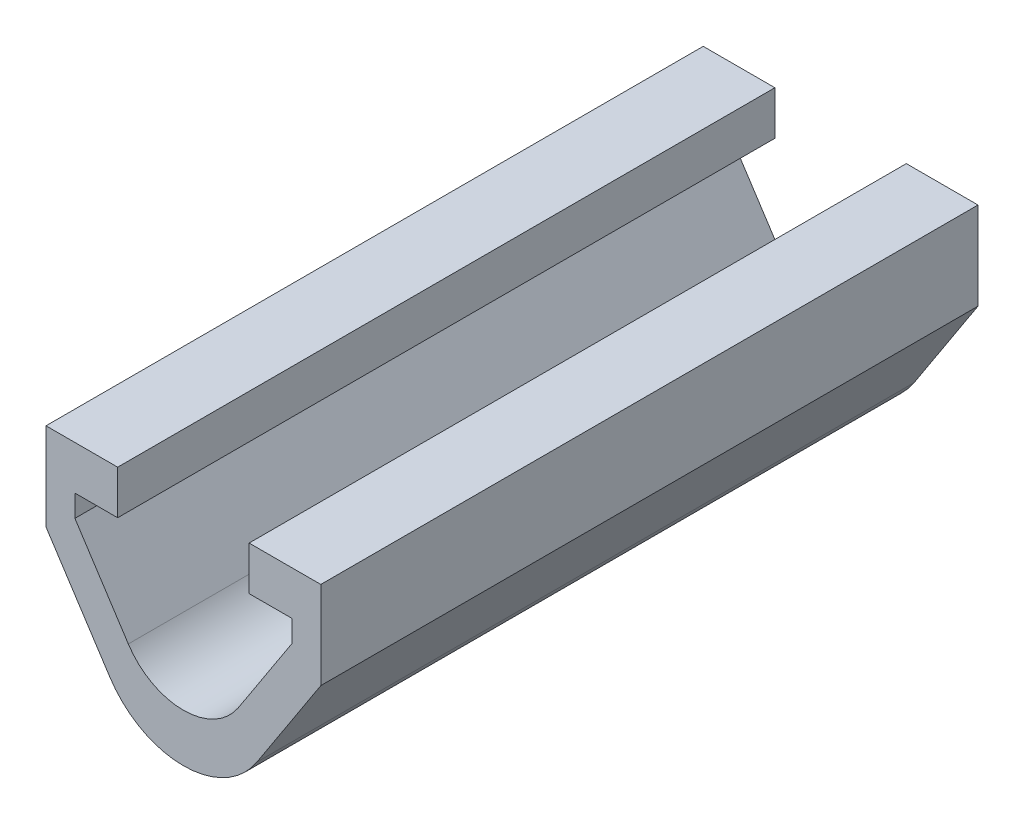
ISO-10303-21;
HEADER;
FILE_DESCRIPTION(('STEP AP214'),'2;1');
FILE_NAME('part.step','',(''),(''),'','','');
FILE_SCHEMA(('AUTOMOTIVE_DESIGN { 1 0 10303 214 1 1 1 1 }'));
ENDSEC;
DATA;
#1=APPLICATION_CONTEXT('core data for automotive mechanical design processes');
#2=APPLICATION_PROTOCOL_DEFINITION('international standard','automotive_design',2000,#1);
#3=PRODUCT_CONTEXT('',#1,'mechanical');
#4=PRODUCT('Part','Part','',(#3));
#5=PRODUCT_RELATED_PRODUCT_CATEGORY('part','',(#4));
#6=PRODUCT_DEFINITION_FORMATION('','',#4);
#7=PRODUCT_DEFINITION_CONTEXT('part definition',#1,'design');
#8=PRODUCT_DEFINITION('design','',#6,#7);
#9=PRODUCT_DEFINITION_SHAPE('','',#8);
#10=(LENGTH_UNIT() NAMED_UNIT(*) SI_UNIT(.MILLI.,.METRE.));
#11=(NAMED_UNIT(*) PLANE_ANGLE_UNIT() SI_UNIT($,.RADIAN.));
#12=(NAMED_UNIT(*) SI_UNIT($,.STERADIAN.) SOLID_ANGLE_UNIT());
#13=UNCERTAINTY_MEASURE_WITH_UNIT(LENGTH_MEASURE(1.E-05),#10,'distance_accuracy_value','');
#14=(GEOMETRIC_REPRESENTATION_CONTEXT(3) GLOBAL_UNCERTAINTY_ASSIGNED_CONTEXT((#13)) GLOBAL_UNIT_ASSIGNED_CONTEXT((#10,
#11,#12)) REPRESENTATION_CONTEXT('',''));
#15=CARTESIAN_POINT('',(0.,0.,0.));
#16=DIRECTION('',(0.,0.,1.));
#17=DIRECTION('',(1.,0.,0.));
#18=AXIS2_PLACEMENT_3D('',#15,#16,#17);
#19=CARTESIAN_POINT('',(-6.27176837943347,-2.50000000000001,30.));
#20=DIRECTION('',(1.,0.,0.));
#21=DIRECTION('',(0.,1.,0.));
#22=AXIS2_PLACEMENT_3D('',#19,#20,#21);
#23=PLANE('',#22);
#24=DIRECTION('',(0.,-1.,0.));
#25=VECTOR('',#24,1.);
#26=CARTESIAN_POINT('',(-6.27176837943347,-2.50000000000001,0.));
#27=LINE('',#26,#25);
#28=CARTESIAN_POINT('',(-6.27176837943347,-2.50000000000001,0.));
#29=VERTEX_POINT('',#28);
#30=CARTESIAN_POINT('',(-6.27176837943347,-6.50000000000001,0.));
#31=VERTEX_POINT('',#30);
#32=EDGE_CURVE('E177',#29,#31,#27,.T.);
#33=ORIENTED_EDGE('',*,*,#32,.T.);
#34=DIRECTION('',(0.,0.,-1.));
#35=VECTOR('',#34,1.);
#36=CARTESIAN_POINT('',(-6.27176837943347,-6.50000000000001,30.));
#37=LINE('',#36,#35);
#38=CARTESIAN_POINT('',(-6.27176837943347,-6.50000000000001,30.));
#39=VERTEX_POINT('',#38);
#40=EDGE_CURVE('E11',#39,#31,#37,.T.);
#41=ORIENTED_EDGE('',*,*,#40,.F.);
#42=DIRECTION('',(0.,-1.,0.));
#43=VECTOR('',#42,1.);
#44=CARTESIAN_POINT('',(-6.27176837943347,-2.50000000000001,30.));
#45=LINE('',#44,#43);
#46=CARTESIAN_POINT('',(-6.27176837943347,-2.50000000000001,30.));
#47=VERTEX_POINT('',#46);
#48=EDGE_CURVE('E214',#47,#39,#45,.T.);
#49=ORIENTED_EDGE('',*,*,#48,.F.);
#50=DIRECTION('',(0.,0.,-1.));
#51=VECTOR('',#50,1.);
#52=CARTESIAN_POINT('',(-6.27176837943347,-2.50000000000001,30.));
#53=LINE('',#52,#51);
#54=EDGE_CURVE('E173',#47,#29,#53,.T.);
#55=ORIENTED_EDGE('',*,*,#54,.T.);
#56=EDGE_LOOP('',(#33,#41,#49,#55));
#57=FACE_BOUND('',#56,.T.);
#58=ADVANCED_FACE('F33',(#57),#23,.F.);
#59=CARTESIAN_POINT('',(-6.27176837943347,-6.50000000000001,30.));
#60=DIRECTION('',(0.838139532599552,0.545455886294946,0.));
#61=DIRECTION('',(-0.545455886294946,0.838139532599552,0.));
#62=AXIS2_PLACEMENT_3D('',#59,#60,#61);
#63=PLANE('',#62);
#64=DIRECTION('',(0.545455886294946,-0.838139532599552,0.));
#65=VECTOR('',#64,1.);
#66=CARTESIAN_POINT('',(-6.27176837943347,-6.50000000000001,0.));
#67=LINE('',#66,#65);
#68=CARTESIAN_POINT('',(-3.35255813039823,-10.9856157485176,0.));
#69=VERTEX_POINT('',#68);
#70=EDGE_CURVE('E180',#31,#69,#67,.T.);
#71=ORIENTED_EDGE('',*,*,#70,.T.);
#72=DIRECTION('',(0.,0.,-1.));
#73=VECTOR('',#72,1.);
#74=CARTESIAN_POINT('',(-3.35255813039823,-10.9856157485176,30.));
#75=LINE('',#74,#73);
#76=CARTESIAN_POINT('',(-3.35255813039823,-10.9856157485176,30.));
#77=VERTEX_POINT('',#76);
#78=EDGE_CURVE('E41',#77,#69,#75,.T.);
#79=ORIENTED_EDGE('',*,*,#78,.F.);
#80=DIRECTION('',(0.545455886294946,-0.838139532599552,0.));
#81=VECTOR('',#80,1.);
#82=CARTESIAN_POINT('',(-6.27176837943347,-6.50000000000001,30.));
#83=LINE('',#82,#81);
#84=EDGE_CURVE('E116',#39,#77,#83,.T.);
#85=ORIENTED_EDGE('',*,*,#84,.F.);
#86=ORIENTED_EDGE('',*,*,#40,.T.);
#87=EDGE_LOOP('',(#71,#79,#85,#86));
#88=FACE_BOUND('',#87,.T.);
#89=ADVANCED_FACE('F313',(#88),#63,.F.);
#90=CARTESIAN_POINT('',(0.,-8.80379220333782,30.));
#91=DIRECTION('',(0.,0.,-1.));
#92=DIRECTION('',(-1.,0.,0.));
#93=AXIS2_PLACEMENT_3D('',#90,#91,#92);
#94=CYLINDRICAL_SURFACE('',#93,4.);
#95=CARTESIAN_POINT('',(0.,-8.80379220333782,0.));
#96=DIRECTION('',(0.,0.,1.));
#97=DIRECTION('',(1.,0.,0.));
#98=AXIS2_PLACEMENT_3D('',#95,#96,#97);
#99=CIRCLE('',#98,4.);
#100=CARTESIAN_POINT('',(3.35255813039823,-10.9856157485176,0.));
#101=VERTEX_POINT('',#100);
#102=EDGE_CURVE('E182',#69,#101,#99,.T.);
#103=ORIENTED_EDGE('',*,*,#102,.T.);
#104=DIRECTION('',(0.,0.,-1.));
#105=VECTOR('',#104,1.);
#106=CARTESIAN_POINT('',(3.35255813039823,-10.9856157485176,30.));
#107=LINE('',#106,#105);
#108=CARTESIAN_POINT('',(3.35255813039823,-10.9856157485176,30.));
#109=VERTEX_POINT('',#108);
#110=EDGE_CURVE('E239',#109,#101,#107,.T.);
#111=ORIENTED_EDGE('',*,*,#110,.F.);
#112=CARTESIAN_POINT('',(0.,-8.80379220333782,30.));
#113=DIRECTION('',(0.,0.,1.));
#114=DIRECTION('',(1.,0.,0.));
#115=AXIS2_PLACEMENT_3D('',#112,#113,#114);
#116=CIRCLE('',#115,4.);
#117=EDGE_CURVE('E247',#77,#109,#116,.T.);
#118=ORIENTED_EDGE('',*,*,#117,.F.);
#119=ORIENTED_EDGE('',*,*,#78,.T.);
#120=EDGE_LOOP('',(#103,#111,#118,#119));
#121=FACE_BOUND('',#120,.T.);
#122=ADVANCED_FACE('F245',(#121),#94,.T.);
#123=CARTESIAN_POINT('',(3.35255813039823,-10.9856157485176,30.));
#124=DIRECTION('',(-0.838139532599551,0.545455886294946,0.));
#125=DIRECTION('',(-0.545455886294946,-0.838139532599552,0.));
#126=AXIS2_PLACEMENT_3D('',#123,#124,#125);
#127=PLANE('',#126);
#128=DIRECTION('',(0.545455886294946,0.838139532599552,0.));
#129=VECTOR('',#128,1.);
#130=CARTESIAN_POINT('',(3.35255813039823,-10.9856157485176,0.));
#131=LINE('',#130,#129);
#132=CARTESIAN_POINT('',(6.27176837943347,-6.50000000000001,0.));
#133=VERTEX_POINT('',#132);
#134=EDGE_CURVE('E184',#101,#133,#131,.T.);
#135=ORIENTED_EDGE('',*,*,#134,.T.);
#136=DIRECTION('',(0.,0.,-1.));
#137=VECTOR('',#136,1.);
#138=CARTESIAN_POINT('',(6.27176837943347,-6.50000000000001,30.));
#139=LINE('',#138,#137);
#140=CARTESIAN_POINT('',(6.27176837943347,-6.50000000000001,30.));
#141=VERTEX_POINT('',#140);
#142=EDGE_CURVE('E237',#141,#133,#139,.T.);
#143=ORIENTED_EDGE('',*,*,#142,.F.);
#144=DIRECTION('',(0.545455886294946,0.838139532599552,0.));
#145=VECTOR('',#144,1.);
#146=CARTESIAN_POINT('',(3.35255813039823,-10.9856157485176,30.));
#147=LINE('',#146,#145);
#148=EDGE_CURVE('E258',#109,#141,#147,.T.);
#149=ORIENTED_EDGE('',*,*,#148,.F.);
#150=ORIENTED_EDGE('',*,*,#110,.T.);
#151=EDGE_LOOP('',(#135,#143,#149,#150));
#152=FACE_BOUND('',#151,.T.);
#153=ADVANCED_FACE('F255',(#152),#127,.F.);
#154=CARTESIAN_POINT('',(6.27176837943347,-2.50000000000001,30.));
#155=DIRECTION('',(1.,0.,0.));
#156=DIRECTION('',(0.,1.,0.));
#157=AXIS2_PLACEMENT_3D('',#154,#155,#156);
#158=PLANE('',#157);
#159=DIRECTION('',(0.,-1.,0.));
#160=VECTOR('',#159,1.);
#161=CARTESIAN_POINT('',(6.27176837943347,-2.50000000000001,0.));
#162=LINE('',#161,#160);
#163=CARTESIAN_POINT('',(6.27176837943347,-2.50000000000001,0.));
#164=VERTEX_POINT('',#163);
#165=EDGE_CURVE('E187',#164,#133,#162,.T.);
#166=ORIENTED_EDGE('',*,*,#165,.F.);
#167=DIRECTION('',(0.,0.,-1.));
#168=VECTOR('',#167,1.);
#169=CARTESIAN_POINT('',(6.27176837943347,-2.50000000000001,30.));
#170=LINE('',#169,#168);
#171=CARTESIAN_POINT('',(6.27176837943347,-2.50000000000001,30.));
#172=VERTEX_POINT('',#171);
#173=EDGE_CURVE('E235',#172,#164,#170,.T.);
#174=ORIENTED_EDGE('',*,*,#173,.F.);
#175=DIRECTION('',(0.,-1.,0.));
#176=VECTOR('',#175,1.);
#177=CARTESIAN_POINT('',(6.27176837943347,-2.50000000000001,30.));
#178=LINE('',#177,#176);
#179=EDGE_CURVE('E260',#172,#141,#178,.T.);
#180=ORIENTED_EDGE('',*,*,#179,.T.);
#181=ORIENTED_EDGE('',*,*,#142,.T.);
#182=EDGE_LOOP('',(#166,#174,#180,#181));
#183=FACE_BOUND('',#182,.T.);
#184=ADVANCED_FACE('F324',(#183),#158,.T.);
#185=CARTESIAN_POINT('',(3.,-2.50000000000001,30.));
#186=DIRECTION('',(0.,1.,0.));
#187=DIRECTION('',(-1.,0.,0.));
#188=AXIS2_PLACEMENT_3D('',#185,#186,#187);
#189=PLANE('',#188);
#190=DIRECTION('',(1.,0.,0.));
#191=VECTOR('',#190,1.);
#192=CARTESIAN_POINT('',(3.,-2.50000000000001,0.));
#193=LINE('',#192,#191);
#194=CARTESIAN_POINT('',(3.,-2.50000000000001,0.));
#195=VERTEX_POINT('',#194);
#196=EDGE_CURVE('E190',#195,#164,#193,.T.);
#197=ORIENTED_EDGE('',*,*,#196,.F.);
#198=DIRECTION('',(0.,0.,-1.));
#199=VECTOR('',#198,1.);
#200=CARTESIAN_POINT('',(3.,-2.50000000000001,30.));
#201=LINE('',#200,#199);
#202=CARTESIAN_POINT('',(3.,-2.50000000000001,30.));
#203=VERTEX_POINT('',#202);
#204=EDGE_CURVE('E233',#203,#195,#201,.T.);
#205=ORIENTED_EDGE('',*,*,#204,.F.);
#206=DIRECTION('',(1.,0.,0.));
#207=VECTOR('',#206,1.);
#208=CARTESIAN_POINT('',(3.,-2.50000000000001,30.));
#209=LINE('',#208,#207);
#210=EDGE_CURVE('E262',#203,#172,#209,.T.);
#211=ORIENTED_EDGE('',*,*,#210,.T.);
#212=ORIENTED_EDGE('',*,*,#173,.T.);
#213=EDGE_LOOP('',(#197,#205,#211,#212));
#214=FACE_BOUND('',#213,.T.);
#215=ADVANCED_FACE('F327',(#214),#189,.T.);
#216=CARTESIAN_POINT('',(3.,-4.50000000000001,30.));
#217=DIRECTION('',(-1.,0.,0.));
#218=DIRECTION('',(0.,-1.,0.));
#219=AXIS2_PLACEMENT_3D('',#216,#217,#218);
#220=PLANE('',#219);
#221=DIRECTION('',(0.,1.,0.));
#222=VECTOR('',#221,1.);
#223=CARTESIAN_POINT('',(3.,-4.50000000000001,0.));
#224=LINE('',#223,#222);
#225=CARTESIAN_POINT('',(3.,-4.50000000000001,0.));
#226=VERTEX_POINT('',#225);
#227=EDGE_CURVE('E193',#226,#195,#224,.T.);
#228=ORIENTED_EDGE('',*,*,#227,.F.);
#229=DIRECTION('',(0.,0.,-1.));
#230=VECTOR('',#229,1.);
#231=CARTESIAN_POINT('',(3.,-4.50000000000001,30.));
#232=LINE('',#231,#230);
#233=CARTESIAN_POINT('',(3.,-4.50000000000001,30.));
#234=VERTEX_POINT('',#233);
#235=EDGE_CURVE('E231',#234,#226,#232,.T.);
#236=ORIENTED_EDGE('',*,*,#235,.F.);
#237=DIRECTION('',(0.,1.,0.));
#238=VECTOR('',#237,1.);
#239=CARTESIAN_POINT('',(3.,-4.50000000000001,30.));
#240=LINE('',#239,#238);
#241=EDGE_CURVE('E269',#234,#203,#240,.T.);
#242=ORIENTED_EDGE('',*,*,#241,.T.);
#243=ORIENTED_EDGE('',*,*,#204,.T.);
#244=EDGE_LOOP('',(#228,#236,#242,#243));
#245=FACE_BOUND('',#244,.T.);
#246=ADVANCED_FACE('F331',(#245),#220,.T.);
#247=CARTESIAN_POINT('',(4.95238095238095,-4.50000000000001,30.));
#248=DIRECTION('',(0.,-1.,0.));
#249=DIRECTION('',(0.,0.,-1.));
#250=AXIS2_PLACEMENT_3D('',#247,#248,#249);
#251=PLANE('',#250);
#252=DIRECTION('',(-1.,0.,0.));
#253=VECTOR('',#252,1.);
#254=CARTESIAN_POINT('',(4.95238095238095,-4.50000000000001,0.));
#255=LINE('',#254,#253);
#256=CARTESIAN_POINT('',(4.95238095238095,-4.50000000000001,0.));
#257=VERTEX_POINT('',#256);
#258=EDGE_CURVE('E196',#257,#226,#255,.T.);
#259=ORIENTED_EDGE('',*,*,#258,.F.);
#260=DIRECTION('',(0.,0.,-1.));
#261=VECTOR('',#260,1.);
#262=CARTESIAN_POINT('',(4.95238095238095,-4.50000000000001,30.));
#263=LINE('',#262,#261);
#264=CARTESIAN_POINT('',(4.95238095238095,-4.50000000000001,30.));
#265=VERTEX_POINT('',#264);
#266=EDGE_CURVE('E229',#265,#257,#263,.T.);
#267=ORIENTED_EDGE('',*,*,#266,.F.);
#268=DIRECTION('',(-1.,0.,0.));
#269=VECTOR('',#268,1.);
#270=CARTESIAN_POINT('',(4.95238095238095,-4.50000000000001,30.));
#271=LINE('',#270,#269);
#272=EDGE_CURVE('E272',#265,#234,#271,.T.);
#273=ORIENTED_EDGE('',*,*,#272,.T.);
#274=ORIENTED_EDGE('',*,*,#235,.T.);
#275=EDGE_LOOP('',(#259,#267,#273,#274));
#276=FACE_BOUND('',#275,.T.);
#277=ADVANCED_FACE('F335',(#276),#251,.T.);
#278=CARTESIAN_POINT('',(4.95238095238095,-5.50000000000001,30.));
#279=DIRECTION('',(-1.,0.,0.));
#280=DIRECTION('',(0.,0.,1.));
#281=AXIS2_PLACEMENT_3D('',#278,#279,#280);
#282=PLANE('',#281);
#283=DIRECTION('',(0.,1.,0.));
#284=VECTOR('',#283,1.);
#285=CARTESIAN_POINT('',(4.95238095238095,-5.50000000000001,0.));
#286=LINE('',#285,#284);
#287=CARTESIAN_POINT('',(4.95238095238095,-5.50000000000001,0.));
#288=VERTEX_POINT('',#287);
#289=EDGE_CURVE('E199',#288,#257,#286,.T.);
#290=ORIENTED_EDGE('',*,*,#289,.F.);
#291=DIRECTION('',(0.,0.,-1.));
#292=VECTOR('',#291,1.);
#293=CARTESIAN_POINT('',(4.95238095238095,-5.50000000000001,30.));
#294=LINE('',#293,#292);
#295=CARTESIAN_POINT('',(4.95238095238095,-5.50000000000001,30.));
#296=VERTEX_POINT('',#295);
#297=EDGE_CURVE('E226',#296,#288,#294,.T.);
#298=ORIENTED_EDGE('',*,*,#297,.F.);
#299=DIRECTION('',(0.,1.,0.));
#300=VECTOR('',#299,1.);
#301=CARTESIAN_POINT('',(4.95238095238095,-5.50000000000001,30.));
#302=LINE('',#301,#300);
#303=EDGE_CURVE('E275',#296,#265,#302,.T.);
#304=ORIENTED_EDGE('',*,*,#303,.T.);
#305=ORIENTED_EDGE('',*,*,#266,.T.);
#306=EDGE_LOOP('',(#290,#298,#304,#305));
#307=FACE_BOUND('',#306,.T.);
#308=ADVANCED_FACE('F339',(#307),#282,.T.);
#309=CARTESIAN_POINT('',(2.51441859779867,-9.24613727655327,30.));
#310=DIRECTION('',(-0.838139532599552,0.545455886294946,0.));
#311=DIRECTION('',(-0.545455886294946,-0.838139532599552,0.));
#312=AXIS2_PLACEMENT_3D('',#309,#310,#311);
#313=PLANE('',#312);
#314=DIRECTION('',(0.545455886294946,0.838139532599552,0.));
#315=VECTOR('',#314,1.);
#316=CARTESIAN_POINT('',(2.51441859779867,-9.24613727655327,0.));
#317=LINE('',#316,#315);
#318=CARTESIAN_POINT('',(2.51441859779867,-9.24613727655327,0.));
#319=VERTEX_POINT('',#318);
#320=EDGE_CURVE('E202',#319,#288,#317,.T.);
#321=ORIENTED_EDGE('',*,*,#320,.F.);
#322=DIRECTION('',(0.,0.,-1.));
#323=VECTOR('',#322,1.);
#324=CARTESIAN_POINT('',(2.51441859779867,-9.24613727655327,30.));
#325=LINE('',#324,#323);
#326=CARTESIAN_POINT('',(2.51441859779867,-9.24613727655327,30.));
#327=VERTEX_POINT('',#326);
#328=EDGE_CURVE('E224',#327,#319,#325,.T.);
#329=ORIENTED_EDGE('',*,*,#328,.F.);
#330=DIRECTION('',(0.545455886294946,0.838139532599551,0.));
#331=VECTOR('',#330,1.);
#332=CARTESIAN_POINT('',(3.,-8.50000000000001,30.));
#333=LINE('',#332,#331);
#334=EDGE_CURVE('E278',#327,#296,#333,.T.);
#335=ORIENTED_EDGE('',*,*,#334,.T.);
#336=ORIENTED_EDGE('',*,*,#297,.T.);
#337=EDGE_LOOP('',(#321,#329,#335,#336));
#338=FACE_BOUND('',#337,.T.);
#339=ADVANCED_FACE('F343',(#338),#313,.T.);
#340=CARTESIAN_POINT('',(0.,-7.60976961766846,30.));
#341=DIRECTION('',(0.,0.,-1.));
#342=DIRECTION('',(-1.,0.,0.));
#343=AXIS2_PLACEMENT_3D('',#340,#341,#342);
#344=CYLINDRICAL_SURFACE('',#343,3.);
#345=CARTESIAN_POINT('',(0.,-7.60976961766846,0.));
#346=DIRECTION('',(0.,0.,1.));
#347=DIRECTION('',(1.,0.,0.));
#348=AXIS2_PLACEMENT_3D('',#345,#346,#347);
#349=CIRCLE('',#348,3.);
#350=CARTESIAN_POINT('',(-2.51441859779867,-9.24613727655327,0.));
#351=VERTEX_POINT('',#350);
#352=EDGE_CURVE('E204',#351,#319,#349,.T.);
#353=ORIENTED_EDGE('',*,*,#352,.F.);
#354=DIRECTION('',(0.,0.,-1.));
#355=VECTOR('',#354,1.);
#356=CARTESIAN_POINT('',(-2.51441859779867,-9.24613727655327,30.));
#357=LINE('',#356,#355);
#358=CARTESIAN_POINT('',(-2.51441859779867,-9.24613727655327,30.));
#359=VERTEX_POINT('',#358);
#360=EDGE_CURVE('E221',#359,#351,#357,.T.);
#361=ORIENTED_EDGE('',*,*,#360,.F.);
#362=CARTESIAN_POINT('',(0.,-7.60976961766846,30.));
#363=DIRECTION('',(0.,0.,1.));
#364=DIRECTION('',(1.,0.,0.));
#365=AXIS2_PLACEMENT_3D('',#362,#363,#364);
#366=CIRCLE('',#365,3.);
#367=EDGE_CURVE('E281',#359,#327,#366,.T.);
#368=ORIENTED_EDGE('',*,*,#367,.T.);
#369=ORIENTED_EDGE('',*,*,#328,.T.);
#370=EDGE_LOOP('',(#353,#361,#368,#369));
#371=FACE_BOUND('',#370,.T.);
#372=ADVANCED_FACE('F294',(#371),#344,.F.);
#373=CARTESIAN_POINT('',(-3.,-8.50000000000001,30.));
#374=DIRECTION('',(-0.838139532599552,-0.545455886294946,0.));
#375=DIRECTION('',(0.545455886294946,-0.838139532599552,0.));
#376=AXIS2_PLACEMENT_3D('',#373,#374,#375);
#377=PLANE('',#376);
#378=DIRECTION('',(-0.545455886294946,0.838139532599552,0.));
#379=VECTOR('',#378,1.);
#380=CARTESIAN_POINT('',(-3.,-8.50000000000001,0.));
#381=LINE('',#380,#379);
#382=CARTESIAN_POINT('',(-4.95238095238095,-5.50000000000001,0.));
#383=VERTEX_POINT('',#382);
#384=EDGE_CURVE('E207',#351,#383,#381,.T.);
#385=ORIENTED_EDGE('',*,*,#384,.T.);
#386=DIRECTION('',(0.,0.,-1.));
#387=VECTOR('',#386,1.);
#388=CARTESIAN_POINT('',(-4.95238095238095,-5.50000000000001,30.));
#389=LINE('',#388,#387);
#390=CARTESIAN_POINT('',(-4.95238095238095,-5.50000000000001,30.));
#391=VERTEX_POINT('',#390);
#392=EDGE_CURVE('E218',#391,#383,#389,.T.);
#393=ORIENTED_EDGE('',*,*,#392,.F.);
#394=DIRECTION('',(0.545455886294946,-0.838139532599552,0.));
#395=VECTOR('',#394,1.);
#396=CARTESIAN_POINT('',(-3.,-8.50000000000001,30.));
#397=LINE('',#396,#395);
#398=EDGE_CURVE('E284',#391,#359,#397,.T.);
#399=ORIENTED_EDGE('',*,*,#398,.T.);
#400=ORIENTED_EDGE('',*,*,#360,.T.);
#401=EDGE_LOOP('',(#385,#393,#399,#400));
#402=FACE_BOUND('',#401,.T.);
#403=ADVANCED_FACE('F288',(#402),#377,.F.);
#404=CARTESIAN_POINT('',(-4.95238095238095,-5.50000000000001,30.));
#405=DIRECTION('',(-1.,0.,0.));
#406=DIRECTION('',(0.,0.,1.));
#407=AXIS2_PLACEMENT_3D('',#404,#405,#406);
#408=PLANE('',#407);
#409=DIRECTION('',(0.,1.,0.));
#410=VECTOR('',#409,1.);
#411=CARTESIAN_POINT('',(-4.95238095238095,-5.50000000000001,0.));
#412=LINE('',#411,#410);
#413=CARTESIAN_POINT('',(-4.95238095238095,-4.50000000000001,0.));
#414=VERTEX_POINT('',#413);
#415=EDGE_CURVE('E209',#383,#414,#412,.T.);
#416=ORIENTED_EDGE('',*,*,#415,.T.);
#417=DIRECTION('',(0.,0.,-1.));
#418=VECTOR('',#417,1.);
#419=CARTESIAN_POINT('',(-4.95238095238095,-4.50000000000001,30.));
#420=LINE('',#419,#418);
#421=CARTESIAN_POINT('',(-4.95238095238095,-4.50000000000001,30.));
#422=VERTEX_POINT('',#421);
#423=EDGE_CURVE('E168',#422,#414,#420,.T.);
#424=ORIENTED_EDGE('',*,*,#423,.F.);
#425=DIRECTION('',(0.,1.,0.));
#426=VECTOR('',#425,1.);
#427=CARTESIAN_POINT('',(-4.95238095238095,-5.50000000000001,30.));
#428=LINE('',#427,#426);
#429=EDGE_CURVE('E159',#391,#422,#428,.T.);
#430=ORIENTED_EDGE('',*,*,#429,.F.);
#431=ORIENTED_EDGE('',*,*,#392,.T.);
#432=EDGE_LOOP('',(#416,#424,#430,#431));
#433=FACE_BOUND('',#432,.T.);
#434=ADVANCED_FACE('F298',(#433),#408,.F.);
#435=CARTESIAN_POINT('',(-4.95238095238095,-4.50000000000001,30.));
#436=DIRECTION('',(0.,1.,0.));
#437=DIRECTION('',(0.,0.,1.));
#438=AXIS2_PLACEMENT_3D('',#435,#436,#437);
#439=PLANE('',#438);
#440=DIRECTION('',(1.,0.,0.));
#441=VECTOR('',#440,1.);
#442=CARTESIAN_POINT('',(-4.95238095238095,-4.50000000000001,0.));
#443=LINE('',#442,#441);
#444=CARTESIAN_POINT('',(-3.,-4.50000000000001,0.));
#445=VERTEX_POINT('',#444);
#446=EDGE_CURVE('E167',#414,#445,#443,.T.);
#447=ORIENTED_EDGE('',*,*,#446,.T.);
#448=DIRECTION('',(0.,0.,-1.));
#449=VECTOR('',#448,1.);
#450=CARTESIAN_POINT('',(-3.,-4.50000000000001,30.));
#451=LINE('',#450,#449);
#452=CARTESIAN_POINT('',(-3.,-4.50000000000001,30.));
#453=VERTEX_POINT('',#452);
#454=EDGE_CURVE('E164',#453,#445,#451,.T.);
#455=ORIENTED_EDGE('',*,*,#454,.F.);
#456=DIRECTION('',(1.,0.,0.));
#457=VECTOR('',#456,1.);
#458=CARTESIAN_POINT('',(-4.95238095238095,-4.50000000000001,30.));
#459=LINE('',#458,#457);
#460=EDGE_CURVE('E153',#422,#453,#459,.T.);
#461=ORIENTED_EDGE('',*,*,#460,.F.);
#462=ORIENTED_EDGE('',*,*,#423,.T.);
#463=EDGE_LOOP('',(#447,#455,#461,#462));
#464=FACE_BOUND('',#463,.T.);
#465=ADVANCED_FACE('F165',(#464),#439,.F.);
#466=CARTESIAN_POINT('',(-3.,-4.50000000000001,30.));
#467=DIRECTION('',(-1.,0.,0.));
#468=DIRECTION('',(0.,-1.,0.));
#469=AXIS2_PLACEMENT_3D('',#466,#467,#468);
#470=PLANE('',#469);
#471=DIRECTION('',(0.,1.,0.));
#472=VECTOR('',#471,1.);
#473=CARTESIAN_POINT('',(-3.,-4.50000000000001,0.));
#474=LINE('',#473,#472);
#475=CARTESIAN_POINT('',(-3.,-2.50000000000001,0.));
#476=VERTEX_POINT('',#475);
#477=EDGE_CURVE('E102',#445,#476,#474,.T.);
#478=ORIENTED_EDGE('',*,*,#477,.T.);
#479=DIRECTION('',(0.,0.,-1.));
#480=VECTOR('',#479,1.);
#481=CARTESIAN_POINT('',(-3.,-2.50000000000001,30.));
#482=LINE('',#481,#480);
#483=CARTESIAN_POINT('',(-3.,-2.50000000000001,30.));
#484=VERTEX_POINT('',#483);
#485=EDGE_CURVE('E169',#484,#476,#482,.T.);
#486=ORIENTED_EDGE('',*,*,#485,.F.);
#487=DIRECTION('',(0.,1.,0.));
#488=VECTOR('',#487,1.);
#489=CARTESIAN_POINT('',(-3.,-4.50000000000001,30.));
#490=LINE('',#489,#488);
#491=EDGE_CURVE('E157',#453,#484,#490,.T.);
#492=ORIENTED_EDGE('',*,*,#491,.F.);
#493=ORIENTED_EDGE('',*,*,#454,.T.);
#494=EDGE_LOOP('',(#478,#486,#492,#493));
#495=FACE_BOUND('',#494,.T.);
#496=ADVANCED_FACE('F171',(#495),#470,.F.);
#497=CARTESIAN_POINT('',(-3.,-2.50000000000001,30.));
#498=DIRECTION('',(0.,-1.,0.));
#499=DIRECTION('',(1.,0.,0.));
#500=AXIS2_PLACEMENT_3D('',#497,#498,#499);
#501=PLANE('',#500);
#502=DIRECTION('',(-1.,0.,0.));
#503=VECTOR('',#502,1.);
#504=CARTESIAN_POINT('',(-3.,-2.50000000000001,0.));
#505=LINE('',#504,#503);
#506=EDGE_CURVE('E108',#476,#29,#505,.T.);
#507=ORIENTED_EDGE('',*,*,#506,.T.);
#508=ORIENTED_EDGE('',*,*,#54,.F.);
#509=DIRECTION('',(-1.,0.,0.));
#510=VECTOR('',#509,1.);
#511=CARTESIAN_POINT('',(-3.,-2.50000000000001,30.));
#512=LINE('',#511,#510);
#513=EDGE_CURVE('E49',#484,#47,#512,.T.);
#514=ORIENTED_EDGE('',*,*,#513,.F.);
#515=ORIENTED_EDGE('',*,*,#485,.T.);
#516=EDGE_LOOP('',(#507,#508,#514,#515));
#517=FACE_BOUND('',#516,.T.);
#518=ADVANCED_FACE('F302',(#517),#501,.F.);
#519=CARTESIAN_POINT('',(0.,-8.80379220333782,30.));
#520=DIRECTION('',(0.,0.,1.));
#521=DIRECTION('',(1.,0.,0.));
#522=AXIS2_PLACEMENT_3D('',#519,#520,#521);
#523=PLANE('',#522);
#524=ORIENTED_EDGE('',*,*,#48,.T.);
#525=ORIENTED_EDGE('',*,*,#84,.T.);
#526=ORIENTED_EDGE('',*,*,#117,.T.);
#527=ORIENTED_EDGE('',*,*,#148,.T.);
#528=ORIENTED_EDGE('',*,*,#179,.F.);
#529=ORIENTED_EDGE('',*,*,#210,.F.);
#530=ORIENTED_EDGE('',*,*,#241,.F.);
#531=ORIENTED_EDGE('',*,*,#272,.F.);
#532=ORIENTED_EDGE('',*,*,#303,.F.);
#533=ORIENTED_EDGE('',*,*,#334,.F.);
#534=ORIENTED_EDGE('',*,*,#367,.F.);
#535=ORIENTED_EDGE('',*,*,#398,.F.);
#536=ORIENTED_EDGE('',*,*,#429,.T.);
#537=ORIENTED_EDGE('',*,*,#460,.T.);
#538=ORIENTED_EDGE('',*,*,#491,.T.);
#539=ORIENTED_EDGE('',*,*,#513,.T.);
#540=EDGE_LOOP('',(#524,#525,#526,#527,#528,#529,#530,#531,#532,#533,#534,#535,#536,#537,#538,#539));
#541=FACE_BOUND('',#540,.T.);
#542=ADVANCED_FACE('F155',(#541),#523,.T.);
#543=CARTESIAN_POINT('',(0.,-8.80379220333782,0.));
#544=DIRECTION('',(0.,0.,1.));
#545=DIRECTION('',(1.,0.,0.));
#546=AXIS2_PLACEMENT_3D('',#543,#544,#545);
#547=PLANE('',#546);
#548=ORIENTED_EDGE('',*,*,#32,.F.);
#549=ORIENTED_EDGE('',*,*,#506,.F.);
#550=ORIENTED_EDGE('',*,*,#477,.F.);
#551=ORIENTED_EDGE('',*,*,#446,.F.);
#552=ORIENTED_EDGE('',*,*,#415,.F.);
#553=ORIENTED_EDGE('',*,*,#384,.F.);
#554=ORIENTED_EDGE('',*,*,#352,.T.);
#555=ORIENTED_EDGE('',*,*,#320,.T.);
#556=ORIENTED_EDGE('',*,*,#289,.T.);
#557=ORIENTED_EDGE('',*,*,#258,.T.);
#558=ORIENTED_EDGE('',*,*,#227,.T.);
#559=ORIENTED_EDGE('',*,*,#196,.T.);
#560=ORIENTED_EDGE('',*,*,#165,.T.);
#561=ORIENTED_EDGE('',*,*,#134,.F.);
#562=ORIENTED_EDGE('',*,*,#102,.F.);
#563=ORIENTED_EDGE('',*,*,#70,.F.);
#564=EDGE_LOOP('',(#548,#549,#550,#551,#552,#553,#554,#555,#556,#557,#558,#559,#560,#561,#562,#563));
#565=FACE_BOUND('',#564,.T.);
#566=ADVANCED_FACE('F251',(#565),#547,.F.);
#567=CLOSED_SHELL('',(#58,#89,#122,#153,#184,#215,#246,#277,#308,#339,#372,#403,#434,#465,#496,
#518,#542,#566));
#568=MANIFOLD_SOLID_BREP('B2',#567);
#569=ADVANCED_BREP_SHAPE_REPRESENTATION('',(#18,#568),#14);
#570=SHAPE_DEFINITION_REPRESENTATION(#9,#569);
ENDSEC;
END-ISO-10303-21;
